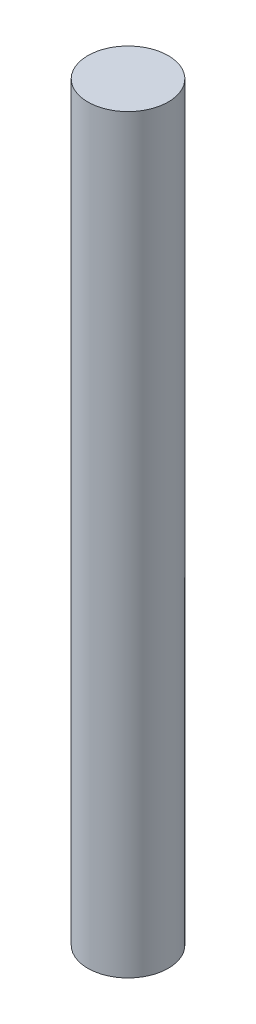
ISO-10303-21;
HEADER;
FILE_DESCRIPTION(('STEP AP214'),'2;1');
FILE_NAME('part.step','',(''),(''),'','','');
FILE_SCHEMA(('AUTOMOTIVE_DESIGN { 1 0 10303 214 1 1 1 1 }'));
ENDSEC;
DATA;
#1=APPLICATION_CONTEXT('core data for automotive mechanical design processes');
#2=APPLICATION_PROTOCOL_DEFINITION('international standard','automotive_design',2000,#1);
#3=PRODUCT_CONTEXT('',#1,'mechanical');
#4=PRODUCT('Part','Part','',(#3));
#5=PRODUCT_RELATED_PRODUCT_CATEGORY('part','',(#4));
#6=PRODUCT_DEFINITION_FORMATION('','',#4);
#7=PRODUCT_DEFINITION_CONTEXT('part definition',#1,'design');
#8=PRODUCT_DEFINITION('design','',#6,#7);
#9=PRODUCT_DEFINITION_SHAPE('','',#8);
#10=(LENGTH_UNIT() NAMED_UNIT(*) SI_UNIT(.MILLI.,.METRE.));
#11=(NAMED_UNIT(*) PLANE_ANGLE_UNIT() SI_UNIT($,.RADIAN.));
#12=(NAMED_UNIT(*) SI_UNIT($,.STERADIAN.) SOLID_ANGLE_UNIT());
#13=UNCERTAINTY_MEASURE_WITH_UNIT(LENGTH_MEASURE(1.E-05),#10,'distance_accuracy_value','');
#14=(GEOMETRIC_REPRESENTATION_CONTEXT(3) GLOBAL_UNCERTAINTY_ASSIGNED_CONTEXT((#13)) GLOBAL_UNIT_ASSIGNED_CONTEXT((#10,
#11,#12)) REPRESENTATION_CONTEXT('',''));
#15=CARTESIAN_POINT('',(0.,0.,0.));
#16=DIRECTION('',(0.,0.,1.));
#17=DIRECTION('',(1.,0.,0.));
#18=AXIS2_PLACEMENT_3D('',#15,#16,#17);
#19=CARTESIAN_POINT('',(0.,0.,-7.50000000000001));
#20=DIRECTION('',(0.,-1.,0.));
#21=DIRECTION('',(0.,0.,-1.));
#22=AXIS2_PLACEMENT_3D('',#19,#20,#21);
#23=PLANE('',#22);
#24=CARTESIAN_POINT('',(0.,0.,0.));
#25=DIRECTION('',(0.,-1.,0.));
#26=DIRECTION('',(0.,0.,-1.));
#27=AXIS2_PLACEMENT_3D('',#24,#25,#26);
#28=CIRCLE('',#27,7.50000000000001);
#29=CARTESIAN_POINT('',(0.,0.,-7.50000000000001));
#30=VERTEX_POINT('',#29);
#31=EDGE_CURVE('E43',#30,#30,#28,.T.);
#32=ORIENTED_EDGE('',*,*,#31,.T.);
#33=EDGE_LOOP('',(#32));
#34=FACE_BOUND('',#33,.T.);
#35=ADVANCED_FACE('F37',(#34),#23,.T.);
#36=CARTESIAN_POINT('',(0.,140.,0.));
#37=DIRECTION('',(0.,1.,0.));
#38=DIRECTION('',(0.,0.,1.));
#39=AXIS2_PLACEMENT_3D('',#36,#37,#38);
#40=PLANE('',#39);
#41=CARTESIAN_POINT('',(0.,140.,0.));
#42=DIRECTION('',(0.,-1.,0.));
#43=DIRECTION('',(0.,0.,-1.));
#44=AXIS2_PLACEMENT_3D('',#41,#42,#43);
#45=CIRCLE('',#44,7.5);
#46=CARTESIAN_POINT('',(0.,140.,-7.5));
#47=VERTEX_POINT('',#46);
#48=EDGE_CURVE('E10',#47,#47,#45,.T.);
#49=ORIENTED_EDGE('',*,*,#48,.F.);
#50=EDGE_LOOP('',(#49));
#51=FACE_BOUND('',#50,.T.);
#52=ADVANCED_FACE('F52',(#51),#40,.T.);
#53=CARTESIAN_POINT('',(0.,0.,0.));
#54=DIRECTION('',(0.,-1.,0.));
#55=DIRECTION('',(0.,0.,-1.));
#56=AXIS2_PLACEMENT_3D('',#53,#54,#55);
#57=CYLINDRICAL_SURFACE('',#56,7.50000000000001);
#58=ORIENTED_EDGE('',*,*,#48,.T.);
#59=EDGE_LOOP('',(#58));
#60=FACE_BOUND('',#59,.T.);
#61=ORIENTED_EDGE('',*,*,#31,.F.);
#62=EDGE_LOOP('',(#61));
#63=FACE_BOUND('',#62,.T.);
#64=ADVANCED_FACE('F50',(#60,#63),#57,.T.);
#65=CLOSED_SHELL('',(#35,#52,#64));
#66=MANIFOLD_SOLID_BREP('B2',#65);
#67=ADVANCED_BREP_SHAPE_REPRESENTATION('',(#18,#66),#14);
#68=SHAPE_DEFINITION_REPRESENTATION(#9,#67);
ENDSEC;
END-ISO-10303-21;
